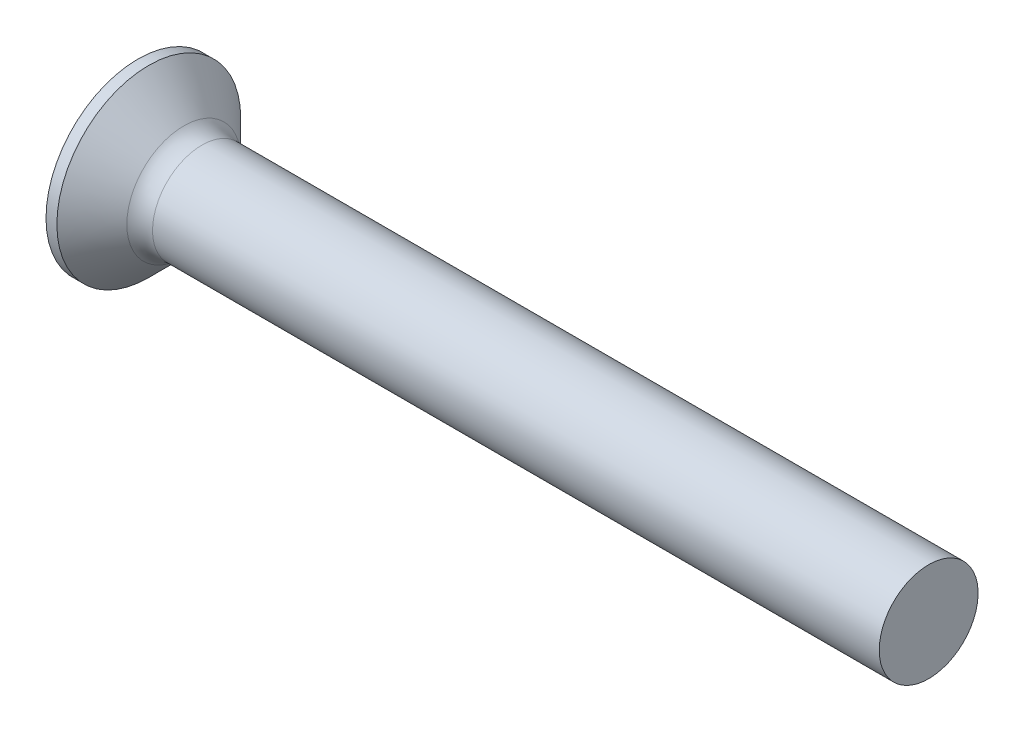
ISO-10303-21;
HEADER;
FILE_DESCRIPTION(('STEP AP214'),'2;1');
FILE_NAME('part.step','',(''),(''),'','','');
FILE_SCHEMA(('AUTOMOTIVE_DESIGN { 1 0 10303 214 1 1 1 1 }'));
ENDSEC;
DATA;
#1=APPLICATION_CONTEXT('core data for automotive mechanical design processes');
#2=APPLICATION_PROTOCOL_DEFINITION('international standard','automotive_design',2000,#1);
#3=PRODUCT_CONTEXT('',#1,'mechanical');
#4=PRODUCT('Part','Part','',(#3));
#5=PRODUCT_RELATED_PRODUCT_CATEGORY('part','',(#4));
#6=PRODUCT_DEFINITION_FORMATION('','',#4);
#7=PRODUCT_DEFINITION_CONTEXT('part definition',#1,'design');
#8=PRODUCT_DEFINITION('design','',#6,#7);
#9=PRODUCT_DEFINITION_SHAPE('','',#8);
#10=(LENGTH_UNIT() NAMED_UNIT(*) SI_UNIT(.MILLI.,.METRE.));
#11=(NAMED_UNIT(*) PLANE_ANGLE_UNIT() SI_UNIT($,.RADIAN.));
#12=(NAMED_UNIT(*) SI_UNIT($,.STERADIAN.) SOLID_ANGLE_UNIT());
#13=UNCERTAINTY_MEASURE_WITH_UNIT(LENGTH_MEASURE(1.E-05),#10,'distance_accuracy_value','');
#14=(GEOMETRIC_REPRESENTATION_CONTEXT(3) GLOBAL_UNCERTAINTY_ASSIGNED_CONTEXT((#13)) GLOBAL_UNIT_ASSIGNED_CONTEXT((#10,
#11,#12)) REPRESENTATION_CONTEXT('',''));
#15=CARTESIAN_POINT('',(0.,0.,0.));
#16=DIRECTION('',(0.,0.,1.));
#17=DIRECTION('',(1.,0.,0.));
#18=AXIS2_PLACEMENT_3D('',#15,#16,#17);
#19=CARTESIAN_POINT('',(0.,0.,0.));
#20=DIRECTION('',(-1.,0.,0.));
#21=DIRECTION('',(0.,0.,1.));
#22=AXIS2_PLACEMENT_3D('',#19,#20,#21);
#23=PLANE('',#22);
#24=CARTESIAN_POINT('',(0.,0.,0.));
#25=DIRECTION('',(-1.,0.,0.));
#26=DIRECTION('',(0.,0.,1.));
#27=AXIS2_PLACEMENT_3D('',#24,#25,#26);
#28=CIRCLE('',#27,4.65);
#29=CARTESIAN_POINT('',(0.,0.,4.65));
#30=VERTEX_POINT('',#29);
#31=EDGE_CURVE('E372',#30,#30,#28,.T.);
#32=ORIENTED_EDGE('',*,*,#31,.T.);
#33=EDGE_LOOP('',(#32));
#34=FACE_BOUND('',#33,.T.);
#35=DIRECTION('',(0.,0.,-1.));
#36=VECTOR('',#35,1.);
#37=CARTESIAN_POINT('',(0.,-0.515000000000008,2.45));
#38=LINE('',#37,#36);
#39=CARTESIAN_POINT('',(0.,-0.515000000000008,2.45));
#40=VERTEX_POINT('',#39);
#41=CARTESIAN_POINT('',(0.,-0.515000000000003,0.931375357653024));
#42=VERTEX_POINT('',#41);
#43=EDGE_CURVE('E310',#40,#42,#38,.T.);
#44=ORIENTED_EDGE('',*,*,#43,.T.);
#45=CARTESIAN_POINT('',(0.,0.,0.));
#46=DIRECTION('',(-1.,0.,0.));
#47=DIRECTION('',(0.,0.,1.));
#48=AXIS2_PLACEMENT_3D('',#45,#46,#47);
#49=CIRCLE('',#48,1.06427677642768);
#50=CARTESIAN_POINT('',(0.,-0.931375357653026,0.515));
#51=VERTEX_POINT('',#50);
#52=EDGE_CURVE('E401',#51,#42,#49,.T.);
#53=ORIENTED_EDGE('',*,*,#52,.F.);
#54=DIRECTION('',(0.,-1.,0.));
#55=VECTOR('',#54,1.);
#56=CARTESIAN_POINT('',(0.,2.45,0.515));
#57=LINE('',#56,#55);
#58=CARTESIAN_POINT('',(0.,-2.45,0.515));
#59=VERTEX_POINT('',#58);
#60=EDGE_CURVE('E336',#51,#59,#57,.T.);
#61=ORIENTED_EDGE('',*,*,#60,.T.);
#62=DIRECTION('',(0.,0.,-1.));
#63=VECTOR('',#62,1.);
#64=CARTESIAN_POINT('',(0.,-2.45,0.515));
#65=LINE('',#64,#63);
#66=CARTESIAN_POINT('',(0.,-2.45,-0.515));
#67=VERTEX_POINT('',#66);
#68=EDGE_CURVE('E341',#59,#67,#65,.T.);
#69=ORIENTED_EDGE('',*,*,#68,.T.);
#70=DIRECTION('',(0.,1.,0.));
#71=VECTOR('',#70,1.);
#72=CARTESIAN_POINT('',(0.,-2.45,-0.515));
#73=LINE('',#72,#71);
#74=CARTESIAN_POINT('',(0.,-0.931375357653026,-0.515));
#75=VERTEX_POINT('',#74);
#76=EDGE_CURVE('E337',#67,#75,#73,.T.);
#77=ORIENTED_EDGE('',*,*,#76,.T.);
#78=CARTESIAN_POINT('',(0.,-0.514999999999997,-0.931375357653028));
#79=VERTEX_POINT('',#78);
#80=EDGE_CURVE('E408',#79,#75,#49,.T.);
#81=ORIENTED_EDGE('',*,*,#80,.F.);
#82=CARTESIAN_POINT('',(0.,-0.514999999999992,-2.45));
#83=VERTEX_POINT('',#82);
#84=EDGE_CURVE('E308',#79,#83,#38,.T.);
#85=ORIENTED_EDGE('',*,*,#84,.T.);
#86=DIRECTION('',(0.,1.,0.));
#87=VECTOR('',#86,1.);
#88=CARTESIAN_POINT('',(0.,-0.514999999999992,-2.45));
#89=LINE('',#88,#87);
#90=CARTESIAN_POINT('',(0.,0.515000000000009,-2.45));
#91=VERTEX_POINT('',#90);
#92=EDGE_CURVE('E289',#83,#91,#89,.T.);
#93=ORIENTED_EDGE('',*,*,#92,.T.);
#94=DIRECTION('',(0.,0.,1.));
#95=VECTOR('',#94,1.);
#96=CARTESIAN_POINT('',(0.,0.515000000000009,-2.45));
#97=LINE('',#96,#95);
#98=CARTESIAN_POINT('',(0.,0.515000000000003,-0.931375357653024));
#99=VERTEX_POINT('',#98);
#100=EDGE_CURVE('E300',#91,#99,#97,.T.);
#101=ORIENTED_EDGE('',*,*,#100,.T.);
#102=CARTESIAN_POINT('',(0.,0.931375357653026,-0.515));
#103=VERTEX_POINT('',#102);
#104=EDGE_CURVE('E404',#103,#99,#49,.T.);
#105=ORIENTED_EDGE('',*,*,#104,.F.);
#106=CARTESIAN_POINT('',(0.,2.45,-0.515));
#107=VERTEX_POINT('',#106);
#108=EDGE_CURVE('E347',#103,#107,#73,.T.);
#109=ORIENTED_EDGE('',*,*,#108,.T.);
#110=DIRECTION('',(0.,0.,1.));
#111=VECTOR('',#110,1.);
#112=CARTESIAN_POINT('',(0.,2.45,-0.515));
#113=LINE('',#112,#111);
#114=CARTESIAN_POINT('',(0.,2.45,0.515));
#115=VERTEX_POINT('',#114);
#116=EDGE_CURVE('E333',#107,#115,#113,.T.);
#117=ORIENTED_EDGE('',*,*,#116,.T.);
#118=CARTESIAN_POINT('',(0.,0.931375357653026,0.515));
#119=VERTEX_POINT('',#118);
#120=EDGE_CURVE('E338',#115,#119,#57,.T.);
#121=ORIENTED_EDGE('',*,*,#120,.T.);
#122=CARTESIAN_POINT('',(0.,0.514999999999997,0.931375357653028));
#123=VERTEX_POINT('',#122);
#124=EDGE_CURVE('E403',#123,#119,#49,.T.);
#125=ORIENTED_EDGE('',*,*,#124,.F.);
#126=CARTESIAN_POINT('',(0.,0.514999999999991,2.45));
#127=VERTEX_POINT('',#126);
#128=EDGE_CURVE('E303',#123,#127,#97,.T.);
#129=ORIENTED_EDGE('',*,*,#128,.T.);
#130=DIRECTION('',(0.,-1.,0.));
#131=VECTOR('',#130,1.);
#132=CARTESIAN_POINT('',(0.,0.514999999999991,2.45));
#133=LINE('',#132,#131);
#134=EDGE_CURVE('E302',#127,#40,#133,.T.);
#135=ORIENTED_EDGE('',*,*,#134,.T.);
#136=EDGE_LOOP('',(#44,#53,#61,#69,#77,#81,#85,#93,#101,#105,#109,#117,#121,#125,#129,#135));
#137=FACE_BOUND('',#136,.T.);
#138=ADVANCED_FACE('F35',(#34,#137),#23,.T.);
#139=CARTESIAN_POINT('',(3.05,-0.929326147908033,0.515));
#140=DIRECTION('',(0.,0.,-1.));
#141=DIRECTION('',(0.,1.,0.));
#142=AXIS2_PLACEMENT_3D('',#139,#140,#141);
#143=PLANE('',#142);
#144=ORIENTED_EDGE('',*,*,#60,.F.);
#145=CARTESIAN_POINT('',(-1.54221347305349,-1.05291860734043,0.515));
#146=CARTESIAN_POINT('',(-1.22007147016316,-1.02783607001973,0.515));
#147=CARTESIAN_POINT('',(-0.89794181675164,-1.002592893973,0.515));
#148=CARTESIAN_POINT('',(-0.253713842852044,-0.951673528807875,0.515));
#149=CARTESIAN_POINT('',(0.0683844773279268,-0.925997335794192,0.515));
#150=CARTESIAN_POINT('',(0.712537341146251,-0.874100649412192,0.515));
#151=CARTESIAN_POINT('',(1.03459188478602,-0.847880156061489,0.515));
#152=CARTESIAN_POINT('',(1.67864013954242,-0.794723210967585,0.515));
#153=CARTESIAN_POINT('',(2.0006338510091,-0.767786763479056,0.515));
#154=CARTESIAN_POINT('',(2.56056239677505,-0.720091607539809,0.515));
#155=CARTESIAN_POINT('',(2.7985160340986,-0.699554136185312,0.515));
#156=CARTESIAN_POINT('',(3.27436149939218,-0.657782810112313,0.515));
#157=CARTESIAN_POINT('',(3.51225332755344,-0.636548957574876,0.515));
#158=CARTESIAN_POINT('',(3.98796007755392,-0.59316517097504,0.515));
#159=CARTESIAN_POINT('',(4.22577499737104,-0.571015214531953,0.515));
#160=CARTESIAN_POINT('',(4.70127802763926,-0.525368927832394,0.515));
#161=CARTESIAN_POINT('',(4.93896613655203,-0.50187258160175,0.515));
#162=CARTESIAN_POINT('',(5.17656597464715,-0.477487906778812,0.515));
#163=B_SPLINE_CURVE_WITH_KNOTS('',3,(#145,#146,#147,#148,#149,#150,#151,#152,#153,#154,#155,
#156,#157,#158,#159,#160,#161,#162),.UNSPECIFIED.,.F.,.F.,(4,2,2,2,2,2,2,2,4),(0.,
0.969351235948301,1.93871119655371,2.90807112578744,3.87742529573196,4.59393929763426,
5.3104510556289,6.0269803285681,6.74351810449256),.UNSPECIFIED.);
#164=CARTESIAN_POINT('',(3.05,-0.677477674908922,0.515));
#165=VERTEX_POINT('',#164);
#166=EDGE_CURVE('E415',#51,#165,#163,.T.);
#167=ORIENTED_EDGE('',*,*,#166,.T.);
#168=DIRECTION('',(0.,-1.,0.));
#169=VECTOR('',#168,1.);
#170=CARTESIAN_POINT('',(3.05,0.929326147908032,0.515));
#171=LINE('',#170,#169);
#172=CARTESIAN_POINT('',(3.05,-0.929326147908032,0.515));
#173=VERTEX_POINT('',#172);
#174=EDGE_CURVE('E361',#165,#173,#171,.T.);
#175=ORIENTED_EDGE('',*,*,#174,.T.);
#176=DIRECTION('',(0.89493436774996,0.446197800778958,0.));
#177=VECTOR('',#176,1.);
#178=CARTESIAN_POINT('',(0.,-2.45,0.515));
#179=LINE('',#178,#177);
#180=EDGE_CURVE('E348',#59,#173,#179,.T.);
#181=ORIENTED_EDGE('',*,*,#180,.F.);
#182=EDGE_LOOP('',(#144,#167,#175,#181));
#183=FACE_BOUND('',#182,.T.);
#184=ADVANCED_FACE('F167',(#183),#143,.T.);
#185=CARTESIAN_POINT('',(3.05,0.929326147908032,0.515));
#186=VERTEX_POINT('',#185);
#187=CARTESIAN_POINT('',(3.05,0.677477674908922,0.515));
#188=VERTEX_POINT('',#187);
#189=EDGE_CURVE('E362',#186,#188,#171,.T.);
#190=ORIENTED_EDGE('',*,*,#189,.T.);
#191=CARTESIAN_POINT('',(-1.54221347305349,1.05291860734043,0.515));
#192=CARTESIAN_POINT('',(-1.22007147016316,1.02783607001973,0.515));
#193=CARTESIAN_POINT('',(-0.89794181675164,1.002592893973,0.515));
#194=CARTESIAN_POINT('',(-0.253713842852044,0.951673528807875,0.515));
#195=CARTESIAN_POINT('',(0.0683844773279269,0.925997335794192,0.515));
#196=CARTESIAN_POINT('',(0.712537341146252,0.874100649412192,0.515));
#197=CARTESIAN_POINT('',(1.03459188478602,0.847880156061489,0.515));
#198=CARTESIAN_POINT('',(1.67864013954242,0.794723210967585,0.515));
#199=CARTESIAN_POINT('',(2.0006338510091,0.767786763479056,0.515));
#200=CARTESIAN_POINT('',(2.56056239677505,0.720091607539809,0.515));
#201=CARTESIAN_POINT('',(2.7985160340986,0.699554136185312,0.515));
#202=CARTESIAN_POINT('',(3.27436149939217,0.657782810112313,0.515));
#203=CARTESIAN_POINT('',(3.51225332755344,0.636548957574876,0.515));
#204=CARTESIAN_POINT('',(3.98796007755392,0.59316517097504,0.515));
#205=CARTESIAN_POINT('',(4.22577499737104,0.571015214531953,0.515));
#206=CARTESIAN_POINT('',(4.70127802763926,0.525368927832394,0.515));
#207=CARTESIAN_POINT('',(4.93896613655203,0.50187258160175,0.515));
#208=CARTESIAN_POINT('',(5.17656597464715,0.477487906778812,0.515));
#209=B_SPLINE_CURVE_WITH_KNOTS('',3,(#191,#192,#193,#194,#195,#196,#197,#198,#199,#200,#201,
#202,#203,#204,#205,#206,#207,#208),.UNSPECIFIED.,.F.,.F.,(4,2,2,2,2,2,2,2,4),(0.,
0.969351235948301,1.93871119655371,2.90807112578744,3.87742529573196,4.59393929763426,
5.3104510556289,6.0269803285681,6.74351810449256),.UNSPECIFIED.);
#210=EDGE_CURVE('E227',#188,#119,#209,.F.);
#211=ORIENTED_EDGE('',*,*,#210,.T.);
#212=ORIENTED_EDGE('',*,*,#120,.F.);
#213=DIRECTION('',(0.89493436774996,-0.446197800778958,0.));
#214=VECTOR('',#213,1.);
#215=CARTESIAN_POINT('',(0.,2.45,0.515));
#216=LINE('',#215,#214);
#217=EDGE_CURVE('E63',#115,#186,#216,.T.);
#218=ORIENTED_EDGE('',*,*,#217,.T.);
#219=EDGE_LOOP('',(#190,#211,#212,#218));
#220=FACE_BOUND('',#219,.T.);
#221=ADVANCED_FACE('F172',(#220),#143,.T.);
#222=CARTESIAN_POINT('',(3.05,0.929326147908032,-0.515));
#223=DIRECTION('',(0.,0.,1.));
#224=DIRECTION('',(1.,0.,0.));
#225=AXIS2_PLACEMENT_3D('',#222,#223,#224);
#226=PLANE('',#225);
#227=DIRECTION('',(0.,1.,0.));
#228=VECTOR('',#227,1.);
#229=CARTESIAN_POINT('',(3.05,-0.929326147908033,-0.515));
#230=LINE('',#229,#228);
#231=CARTESIAN_POINT('',(3.05,-0.929326147908033,-0.515));
#232=VERTEX_POINT('',#231);
#233=CARTESIAN_POINT('',(3.05,-0.677477674908922,-0.515));
#234=VERTEX_POINT('',#233);
#235=EDGE_CURVE('E312',#232,#234,#230,.T.);
#236=ORIENTED_EDGE('',*,*,#235,.T.);
#237=CARTESIAN_POINT('',(-1.54221347058903,-1.05291860714859,-0.515));
#238=CARTESIAN_POINT('',(-1.22007146800241,-1.02783606985067,-0.515));
#239=CARTESIAN_POINT('',(-0.897941814894599,-1.00259289382691,-0.515));
#240=CARTESIAN_POINT('',(-0.253713841602368,-0.951673528708394,-0.515));
#241=CARTESIAN_POINT('',(0.0683844782739385,-0.925997335718345,-0.515));
#242=CARTESIAN_POINT('',(0.712537341258934,-0.874100649402746,-0.515));
#243=CARTESIAN_POINT('',(1.03459188436907,-0.847880156095195,-0.515));
#244=CARTESIAN_POINT('',(1.67864013806642,-0.794723211090119,-0.515));
#245=CARTESIAN_POINT('',(2.00063384900369,-0.767786763647266,-0.515));
#246=CARTESIAN_POINT('',(2.56056239424054,-0.720091607757629,-0.515));
#247=CARTESIAN_POINT('',(2.79851603156427,-0.699554136405275,-0.515));
#248=CARTESIAN_POINT('',(3.27436149685826,-0.657782810337244,-0.515));
#249=CARTESIAN_POINT('',(3.51225332501977,-0.636548957802634,-0.515));
#250=CARTESIAN_POINT('',(3.98796007502083,-0.593165171209449,-0.515));
#251=CARTESIAN_POINT('',(4.22577499483828,-0.571015214770186,-0.515));
#252=CARTESIAN_POINT('',(4.70127802510735,-0.525368928080089,-0.515));
#253=CARTESIAN_POINT('',(4.93896613402064,-0.501872581855082,-0.515));
#254=CARTESIAN_POINT('',(5.17656597211643,-0.477487907039094,-0.515));
#255=B_SPLINE_CURVE_WITH_KNOTS('',3,(#237,#238,#239,#240,#241,#242,#243,#244,#245,#246,#247,
#248,#249,#250,#251,#252,#253,#254),.UNSPECIFIED.,.F.,.F.,(4,2,2,2,2,2,2,2,4),(0.,
0.9693512350346,1.93871119472626,2.90807112236582,3.87742529071622,4.59393929261848,
5.3104510506131,6.02698032355223,6.74351809947659),.UNSPECIFIED.);
#256=EDGE_CURVE('E221',#234,#75,#255,.F.);
#257=ORIENTED_EDGE('',*,*,#256,.T.);
#258=ORIENTED_EDGE('',*,*,#76,.F.);
#259=DIRECTION('',(0.89493436774996,0.446197800778958,0.));
#260=VECTOR('',#259,1.);
#261=CARTESIAN_POINT('',(0.,-2.45,-0.515));
#262=LINE('',#261,#260);
#263=EDGE_CURVE('E351',#67,#232,#262,.T.);
#264=ORIENTED_EDGE('',*,*,#263,.T.);
#265=EDGE_LOOP('',(#236,#257,#258,#264));
#266=FACE_BOUND('',#265,.T.);
#267=ADVANCED_FACE('F207',(#266),#226,.T.);
#268=ORIENTED_EDGE('',*,*,#108,.F.);
#269=CARTESIAN_POINT('',(-1.54221347058903,1.05291860714859,-0.515));
#270=CARTESIAN_POINT('',(-1.22007146800241,1.02783606985067,-0.515));
#271=CARTESIAN_POINT('',(-0.897941814894599,1.00259289382691,-0.515));
#272=CARTESIAN_POINT('',(-0.253713841602368,0.951673528708394,-0.515));
#273=CARTESIAN_POINT('',(0.0683844782739385,0.925997335718345,-0.515));
#274=CARTESIAN_POINT('',(0.712537341258934,0.874100649402746,-0.515));
#275=CARTESIAN_POINT('',(1.03459188436907,0.847880156095195,-0.515));
#276=CARTESIAN_POINT('',(1.67864013806642,0.794723211090119,-0.515));
#277=CARTESIAN_POINT('',(2.00063384900369,0.767786763647266,-0.515));
#278=CARTESIAN_POINT('',(2.56056239424054,0.720091607757629,-0.515));
#279=CARTESIAN_POINT('',(2.79851603156427,0.699554136405275,-0.515));
#280=CARTESIAN_POINT('',(3.27436149685826,0.657782810337244,-0.515));
#281=CARTESIAN_POINT('',(3.51225332501977,0.636548957802634,-0.515));
#282=CARTESIAN_POINT('',(3.98796007502083,0.593165171209449,-0.515));
#283=CARTESIAN_POINT('',(4.22577499483827,0.571015214770186,-0.515));
#284=CARTESIAN_POINT('',(4.70127802510734,0.525368928080089,-0.515));
#285=CARTESIAN_POINT('',(4.93896613402064,0.501872581855082,-0.515));
#286=CARTESIAN_POINT('',(5.17656597211643,0.477487907039095,-0.515));
#287=B_SPLINE_CURVE_WITH_KNOTS('',3,(#269,#270,#271,#272,#273,#274,#275,#276,#277,#278,#279,
#280,#281,#282,#283,#284,#285,#286),.UNSPECIFIED.,.F.,.F.,(4,2,2,2,2,2,2,2,4),(0.,
0.9693512350346,1.93871119472626,2.90807112236582,3.87742529071622,4.59393929261848,
5.3104510506131,6.02698032355223,6.74351809947659),.UNSPECIFIED.);
#288=CARTESIAN_POINT('',(3.05,0.677477674908922,-0.515));
#289=VERTEX_POINT('',#288);
#290=EDGE_CURVE('E215',#103,#289,#287,.T.);
#291=ORIENTED_EDGE('',*,*,#290,.T.);
#292=CARTESIAN_POINT('',(3.05,0.929326147908032,-0.515));
#293=VERTEX_POINT('',#292);
#294=EDGE_CURVE('E309',#289,#293,#230,.T.);
#295=ORIENTED_EDGE('',*,*,#294,.T.);
#296=DIRECTION('',(0.89493436774996,-0.446197800778958,0.));
#297=VECTOR('',#296,1.);
#298=CARTESIAN_POINT('',(0.,2.45,-0.515));
#299=LINE('',#298,#297);
#300=EDGE_CURVE('E355',#107,#293,#299,.T.);
#301=ORIENTED_EDGE('',*,*,#300,.F.);
#302=EDGE_LOOP('',(#268,#291,#295,#301));
#303=FACE_BOUND('',#302,.T.);
#304=ADVANCED_FACE('F199',(#303),#226,.T.);
#305=CARTESIAN_POINT('',(3.05,-0.929326147908033,-0.515));
#306=DIRECTION('',(-1.,0.,0.));
#307=DIRECTION('',(0.,0.,1.));
#308=AXIS2_PLACEMENT_3D('',#305,#306,#307);
#309=PLANE('',#308);
#310=ORIENTED_EDGE('',*,*,#174,.F.);
#311=CARTESIAN_POINT('',(3.05,0.,0.));
#312=DIRECTION('',(-1.,0.,0.));
#313=DIRECTION('',(0.,0.,1.));
#314=AXIS2_PLACEMENT_3D('',#311,#312,#313);
#315=CIRCLE('',#314,0.850999999999999);
#316=EDGE_CURVE('E392',#234,#165,#315,.T.);
#317=ORIENTED_EDGE('',*,*,#316,.F.);
#318=ORIENTED_EDGE('',*,*,#235,.F.);
#319=DIRECTION('',(0.,0.,-1.));
#320=VECTOR('',#319,1.);
#321=CARTESIAN_POINT('',(3.05,-0.929326147908032,0.515));
#322=LINE('',#321,#320);
#323=EDGE_CURVE('E358',#173,#232,#322,.T.);
#324=ORIENTED_EDGE('',*,*,#323,.F.);
#325=EDGE_LOOP('',(#310,#317,#318,#324));
#326=FACE_BOUND('',#325,.T.);
#327=ADVANCED_FACE('F195',(#326),#309,.T.);
#328=DIRECTION('',(0.,0.,-1.));
#329=VECTOR('',#328,1.);
#330=CARTESIAN_POINT('',(3.05,-0.515000000000003,0.92932614790803));
#331=LINE('',#330,#329);
#332=CARTESIAN_POINT('',(3.05,-0.514999999999998,-0.677477674908923));
#333=VERTEX_POINT('',#332);
#334=CARTESIAN_POINT('',(3.05,-0.514999999999997,-0.929326147908034));
#335=VERTEX_POINT('',#334);
#336=EDGE_CURVE('E325',#333,#335,#331,.T.);
#337=ORIENTED_EDGE('',*,*,#336,.F.);
#338=CARTESIAN_POINT('',(3.05,0.515000000000002,-0.67747767490892));
#339=VERTEX_POINT('',#338);
#340=EDGE_CURVE('E399',#339,#333,#315,.T.);
#341=ORIENTED_EDGE('',*,*,#340,.F.);
#342=DIRECTION('',(0.,0.,1.));
#343=VECTOR('',#342,1.);
#344=CARTESIAN_POINT('',(3.05,0.515000000000003,-0.929326147908031));
#345=LINE('',#344,#343);
#346=CARTESIAN_POINT('',(3.05,0.515000000000003,-0.929326147908031));
#347=VERTEX_POINT('',#346);
#348=EDGE_CURVE('E326',#347,#339,#345,.T.);
#349=ORIENTED_EDGE('',*,*,#348,.F.);
#350=DIRECTION('',(0.,1.,0.));
#351=VECTOR('',#350,1.);
#352=CARTESIAN_POINT('',(3.05,-0.514999999999997,-0.929326147908034));
#353=LINE('',#352,#351);
#354=EDGE_CURVE('E292',#335,#347,#353,.T.);
#355=ORIENTED_EDGE('',*,*,#354,.F.);
#356=EDGE_LOOP('',(#337,#341,#349,#355));
#357=FACE_BOUND('',#356,.T.);
#358=ADVANCED_FACE('F198',(#357),#309,.T.);
#359=ORIENTED_EDGE('',*,*,#294,.F.);
#360=EDGE_CURVE('E402',#188,#289,#315,.T.);
#361=ORIENTED_EDGE('',*,*,#360,.F.);
#362=ORIENTED_EDGE('',*,*,#189,.F.);
#363=DIRECTION('',(0.,0.,1.));
#364=VECTOR('',#363,1.);
#365=CARTESIAN_POINT('',(3.05,0.929326147908032,-0.515));
#366=LINE('',#365,#364);
#367=EDGE_CURVE('E359',#293,#186,#366,.T.);
#368=ORIENTED_EDGE('',*,*,#367,.F.);
#369=EDGE_LOOP('',(#359,#361,#362,#368));
#370=FACE_BOUND('',#369,.T.);
#371=ADVANCED_FACE('F431',(#370),#309,.T.);
#372=CARTESIAN_POINT('',(3.05,0.514999999999998,0.677477674908924));
#373=VERTEX_POINT('',#372);
#374=CARTESIAN_POINT('',(3.05,0.514999999999997,0.929326147908034));
#375=VERTEX_POINT('',#374);
#376=EDGE_CURVE('E332',#373,#375,#345,.T.);
#377=ORIENTED_EDGE('',*,*,#376,.F.);
#378=CARTESIAN_POINT('',(3.05,-0.515000000000002,0.67747767490892));
#379=VERTEX_POINT('',#378);
#380=EDGE_CURVE('E400',#379,#373,#315,.T.);
#381=ORIENTED_EDGE('',*,*,#380,.F.);
#382=CARTESIAN_POINT('',(3.05,-0.515000000000003,0.929326147908031));
#383=VERTEX_POINT('',#382);
#384=EDGE_CURVE('E327',#383,#379,#331,.T.);
#385=ORIENTED_EDGE('',*,*,#384,.F.);
#386=DIRECTION('',(0.,-1.,0.));
#387=VECTOR('',#386,1.);
#388=CARTESIAN_POINT('',(3.05,0.514999999999997,0.929326147908034));
#389=LINE('',#388,#387);
#390=EDGE_CURVE('E322',#375,#383,#389,.T.);
#391=ORIENTED_EDGE('',*,*,#390,.F.);
#392=EDGE_LOOP('',(#377,#381,#385,#391));
#393=FACE_BOUND('',#392,.T.);
#394=ADVANCED_FACE('F201',(#393),#309,.T.);
#395=CARTESIAN_POINT('',(3.05,-0.514999999999997,-0.929326147908034));
#396=DIRECTION('',(0.,1.,0.));
#397=DIRECTION('',(0.,0.,1.));
#398=AXIS2_PLACEMENT_3D('',#395,#396,#397);
#399=PLANE('',#398);
#400=ORIENTED_EDGE('',*,*,#84,.F.);
#401=CARTESIAN_POINT('',(-1.54221347058903,-0.514999999999996,-1.05291860714859));
#402=CARTESIAN_POINT('',(-1.22007146800241,-0.514999999999997,-1.02783606985067));
#403=CARTESIAN_POINT('',(-0.897941814894598,-0.514999999999997,-1.00259289382691));
#404=CARTESIAN_POINT('',(-0.253713841602368,-0.514999999999997,-0.951673528708396));
#405=CARTESIAN_POINT('',(0.0683844782739389,-0.514999999999997,-0.925997335718346));
#406=CARTESIAN_POINT('',(0.712537341258934,-0.514999999999997,-0.874100649402748));
#407=CARTESIAN_POINT('',(1.03459188436907,-0.514999999999997,-0.847880156095197));
#408=CARTESIAN_POINT('',(1.67864013806642,-0.514999999999997,-0.794723211090121));
#409=CARTESIAN_POINT('',(2.00063384900369,-0.514999999999997,-0.767786763647268));
#410=CARTESIAN_POINT('',(2.56056239424054,-0.514999999999998,-0.72009160775763));
#411=CARTESIAN_POINT('',(2.79851603156427,-0.514999999999998,-0.699554136405276));
#412=CARTESIAN_POINT('',(3.27436149685826,-0.514999999999998,-0.657782810337246));
#413=CARTESIAN_POINT('',(3.51225332501977,-0.514999999999998,-0.636548957802636));
#414=CARTESIAN_POINT('',(3.98796007502083,-0.514999999999998,-0.59316517120945));
#415=CARTESIAN_POINT('',(4.22577499483828,-0.514999999999998,-0.571015214770188));
#416=CARTESIAN_POINT('',(4.70127802510735,-0.514999999999999,-0.52536892808009));
#417=CARTESIAN_POINT('',(4.93896613402064,-0.514999999999999,-0.501872581855084));
#418=CARTESIAN_POINT('',(5.17656597211643,-0.514999999999999,-0.477487907039096));
#419=B_SPLINE_CURVE_WITH_KNOTS('',3,(#401,#402,#403,#404,#405,#406,#407,#408,#409,#410,#411,
#412,#413,#414,#415,#416,#417,#418),.UNSPECIFIED.,.F.,.F.,(4,2,2,2,2,2,2,2,4),(0.,
0.969351235034601,1.93871119472626,2.90807112236582,3.87742529071622,4.59393929261848,
5.3104510506131,6.02698032355223,6.74351809947659),.UNSPECIFIED.);
#420=EDGE_CURVE('E252',#79,#333,#419,.T.);
#421=ORIENTED_EDGE('',*,*,#420,.T.);
#422=ORIENTED_EDGE('',*,*,#336,.T.);
#423=DIRECTION('',(0.89493436774996,0.,0.446197800778958));
#424=VECTOR('',#423,1.);
#425=CARTESIAN_POINT('',(0.,-0.514999999999992,-2.45));
#426=LINE('',#425,#424);
#427=EDGE_CURVE('E295',#83,#335,#426,.T.);
#428=ORIENTED_EDGE('',*,*,#427,.F.);
#429=EDGE_LOOP('',(#400,#421,#422,#428));
#430=FACE_BOUND('',#429,.T.);
#431=ADVANCED_FACE('F258',(#430),#399,.T.);
#432=CARTESIAN_POINT('',(3.05,0.514999999999997,0.929326147908034));
#433=DIRECTION('',(0.,-1.,0.));
#434=DIRECTION('',(1.,0.,0.));
#435=AXIS2_PLACEMENT_3D('',#432,#433,#434);
#436=PLANE('',#435);
#437=ORIENTED_EDGE('',*,*,#348,.T.);
#438=CARTESIAN_POINT('',(-1.54221347058903,0.515000000000004,-1.05291860714859));
#439=CARTESIAN_POINT('',(-1.22007146800242,0.515000000000003,-1.02783606985067));
#440=CARTESIAN_POINT('',(-0.897941814894599,0.515000000000003,-1.00259289382691));
#441=CARTESIAN_POINT('',(-0.253713841602369,0.515000000000003,-0.951673528708392));
#442=CARTESIAN_POINT('',(0.0683844782739381,0.515000000000003,-0.925997335718343));
#443=CARTESIAN_POINT('',(0.712537341258934,0.515000000000003,-0.874100649402745));
#444=CARTESIAN_POINT('',(1.03459188436907,0.515000000000003,-0.847880156095193));
#445=CARTESIAN_POINT('',(1.67864013806642,0.515000000000003,-0.794723211090117));
#446=CARTESIAN_POINT('',(2.00063384900369,0.515000000000003,-0.767786763647264));
#447=CARTESIAN_POINT('',(2.56056239424054,0.515000000000003,-0.720091607757627));
#448=CARTESIAN_POINT('',(2.79851603156427,0.515000000000003,-0.699554136405273));
#449=CARTESIAN_POINT('',(3.27436149685826,0.515000000000002,-0.657782810337243));
#450=CARTESIAN_POINT('',(3.51225332501977,0.515000000000002,-0.636548957802632));
#451=CARTESIAN_POINT('',(3.98796007502083,0.515000000000002,-0.593165171209447));
#452=CARTESIAN_POINT('',(4.22577499483828,0.515000000000002,-0.571015214770184));
#453=CARTESIAN_POINT('',(4.70127802510735,0.515000000000002,-0.525368928080087));
#454=CARTESIAN_POINT('',(4.93896613402064,0.515000000000002,-0.50187258185508));
#455=CARTESIAN_POINT('',(5.17656597211643,0.515000000000002,-0.477487907039093));
#456=B_SPLINE_CURVE_WITH_KNOTS('',3,(#438,#439,#440,#441,#442,#443,#444,#445,#446,#447,#448,
#449,#450,#451,#452,#453,#454,#455),.UNSPECIFIED.,.F.,.F.,(4,2,2,2,2,2,2,2,4),(0.,
0.969351235034599,1.93871119472626,2.90807112236582,3.87742529071622,4.59393929261848,
5.3104510506131,6.02698032355223,6.74351809947659),.UNSPECIFIED.);
#457=EDGE_CURVE('E247',#339,#99,#456,.F.);
#458=ORIENTED_EDGE('',*,*,#457,.T.);
#459=ORIENTED_EDGE('',*,*,#100,.F.);
#460=DIRECTION('',(0.89493436774996,0.,0.446197800778958));
#461=VECTOR('',#460,1.);
#462=CARTESIAN_POINT('',(0.,0.515000000000009,-2.45));
#463=LINE('',#462,#461);
#464=EDGE_CURVE('E285',#91,#347,#463,.T.);
#465=ORIENTED_EDGE('',*,*,#464,.T.);
#466=EDGE_LOOP('',(#437,#458,#459,#465));
#467=FACE_BOUND('',#466,.T.);
#468=ADVANCED_FACE('F261',(#467),#436,.T.);
#469=ORIENTED_EDGE('',*,*,#384,.T.);
#470=CARTESIAN_POINT('',(-1.54221347305349,-0.515000000000003,1.05291860734043));
#471=CARTESIAN_POINT('',(-1.22007147016316,-0.515000000000003,1.02783607001973));
#472=CARTESIAN_POINT('',(-0.89794181675164,-0.515000000000003,1.002592893973));
#473=CARTESIAN_POINT('',(-0.253713842852044,-0.515000000000003,0.951673528807873));
#474=CARTESIAN_POINT('',(0.0683844773279267,-0.515000000000003,0.92599733579419));
#475=CARTESIAN_POINT('',(0.712537341146251,-0.515000000000003,0.87410064941219));
#476=CARTESIAN_POINT('',(1.03459188478602,-0.515000000000003,0.847880156061488));
#477=CARTESIAN_POINT('',(1.67864013954242,-0.515000000000003,0.794723210967584));
#478=CARTESIAN_POINT('',(2.0006338510091,-0.515000000000003,0.767786763479054));
#479=CARTESIAN_POINT('',(2.56056239677505,-0.515000000000003,0.720091607539807));
#480=CARTESIAN_POINT('',(2.7985160340986,-0.515000000000003,0.69955413618531));
#481=CARTESIAN_POINT('',(3.27436149939218,-0.515000000000002,0.657782810112311));
#482=CARTESIAN_POINT('',(3.51225332755344,-0.515000000000002,0.636548957574874));
#483=CARTESIAN_POINT('',(3.98796007755392,-0.515000000000002,0.593165170975038));
#484=CARTESIAN_POINT('',(4.22577499737104,-0.515000000000002,0.571015214531951));
#485=CARTESIAN_POINT('',(4.70127802763926,-0.515000000000002,0.525368927832392));
#486=CARTESIAN_POINT('',(4.93896613655203,-0.515000000000002,0.501872581601749));
#487=CARTESIAN_POINT('',(5.17656597464715,-0.515000000000002,0.47748790677881));
#488=B_SPLINE_CURVE_WITH_KNOTS('',3,(#470,#471,#472,#473,#474,#475,#476,#477,#478,#479,#480,
#481,#482,#483,#484,#485,#486,#487),.UNSPECIFIED.,.F.,.F.,(4,2,2,2,2,2,2,2,4),(0.,
0.969351235948301,1.93871119655371,2.90807112578744,3.87742529573196,4.59393929763426,
5.3104510556289,6.0269803285681,6.74351810449256),.UNSPECIFIED.);
#489=EDGE_CURVE('E240',#379,#42,#488,.F.);
#490=ORIENTED_EDGE('',*,*,#489,.T.);
#491=ORIENTED_EDGE('',*,*,#43,.F.);
#492=DIRECTION('',(0.89493436774996,0.,-0.446197800778958));
#493=VECTOR('',#492,1.);
#494=CARTESIAN_POINT('',(0.,-0.515000000000008,2.45));
#495=LINE('',#494,#493);
#496=EDGE_CURVE('E296',#40,#383,#495,.T.);
#497=ORIENTED_EDGE('',*,*,#496,.T.);
#498=EDGE_LOOP('',(#469,#490,#491,#497));
#499=FACE_BOUND('',#498,.T.);
#500=ADVANCED_FACE('F263',(#499),#399,.T.);
#501=ORIENTED_EDGE('',*,*,#128,.F.);
#502=CARTESIAN_POINT('',(-1.54221347058903,0.514999999999996,1.05291860714859));
#503=CARTESIAN_POINT('',(-1.22007146800241,0.514999999999996,1.02783606985067));
#504=CARTESIAN_POINT('',(-0.897941814894599,0.514999999999996,1.00259289382691));
#505=CARTESIAN_POINT('',(-0.253713841602368,0.514999999999997,0.951673528708396));
#506=CARTESIAN_POINT('',(0.0683844782739385,0.514999999999997,0.925997335718346));
#507=CARTESIAN_POINT('',(0.712537341258934,0.514999999999997,0.874100649402748));
#508=CARTESIAN_POINT('',(1.03459188436907,0.514999999999997,0.847880156095197));
#509=CARTESIAN_POINT('',(1.67864013806642,0.514999999999997,0.794723211090121));
#510=CARTESIAN_POINT('',(2.00063384900369,0.514999999999997,0.767786763647268));
#511=CARTESIAN_POINT('',(2.56056239424054,0.514999999999998,0.720091607757631));
#512=CARTESIAN_POINT('',(2.79851603156427,0.514999999999998,0.699554136405277));
#513=CARTESIAN_POINT('',(3.27436149685826,0.514999999999998,0.657782810337246));
#514=CARTESIAN_POINT('',(3.51225332501977,0.514999999999998,0.636548957802636));
#515=CARTESIAN_POINT('',(3.98796007502083,0.514999999999998,0.593165171209451));
#516=CARTESIAN_POINT('',(4.22577499483827,0.514999999999998,0.571015214770188));
#517=CARTESIAN_POINT('',(4.70127802510734,0.514999999999998,0.525368928080091));
#518=CARTESIAN_POINT('',(4.93896613402064,0.514999999999998,0.501872581855084));
#519=CARTESIAN_POINT('',(5.17656597211643,0.514999999999998,0.477487907039096));
#520=B_SPLINE_CURVE_WITH_KNOTS('',3,(#502,#503,#504,#505,#506,#507,#508,#509,#510,#511,#512,
#513,#514,#515,#516,#517,#518,#519),.UNSPECIFIED.,.F.,.F.,(4,2,2,2,2,2,2,2,4),(0.,
0.9693512350346,1.93871119472626,2.90807112236582,3.87742529071622,4.59393929261848,
5.3104510506131,6.02698032355223,6.74351809947659),.UNSPECIFIED.);
#521=EDGE_CURVE('E11',#123,#373,#520,.T.);
#522=ORIENTED_EDGE('',*,*,#521,.T.);
#523=ORIENTED_EDGE('',*,*,#376,.T.);
#524=DIRECTION('',(0.89493436774996,0.,-0.446197800778958));
#525=VECTOR('',#524,1.);
#526=CARTESIAN_POINT('',(0.,0.514999999999991,2.45));
#527=LINE('',#526,#525);
#528=EDGE_CURVE('E319',#127,#375,#527,.T.);
#529=ORIENTED_EDGE('',*,*,#528,.F.);
#530=EDGE_LOOP('',(#501,#522,#523,#529));
#531=FACE_BOUND('',#530,.T.);
#532=ADVANCED_FACE('F182',(#531),#436,.T.);
#533=CARTESIAN_POINT('',(-6.34999999999999,0.,0.));
#534=DIRECTION('',(-1.,0.,0.));
#535=DIRECTION('',(0.,0.,1.));
#536=AXIS2_PLACEMENT_3D('',#533,#534,#535);
#537=CYLINDRICAL_SURFACE('',#536,4.65);
#538=CARTESIAN_POINT('',(0.550000000000008,0.,0.));
#539=DIRECTION('',(-1.,0.,0.));
#540=DIRECTION('',(0.,0.,1.));
#541=AXIS2_PLACEMENT_3D('',#538,#539,#540);
#542=CIRCLE('',#541,4.65);
#543=CARTESIAN_POINT('',(0.550000000000008,0.,4.65));
#544=VERTEX_POINT('',#543);
#545=EDGE_CURVE('E369',#544,#544,#542,.T.);
#546=ORIENTED_EDGE('',*,*,#545,.T.);
#547=EDGE_LOOP('',(#546));
#548=FACE_BOUND('',#547,.T.);
#549=ORIENTED_EDGE('',*,*,#31,.F.);
#550=EDGE_LOOP('',(#549));
#551=FACE_BOUND('',#550,.T.);
#552=ADVANCED_FACE('F178',(#548,#551),#537,.T.);
#553=CARTESIAN_POINT('',(0.550000000000008,0.,0.));
#554=DIRECTION('',(-1.,0.,0.));
#555=DIRECTION('',(0.,0.,1.));
#556=AXIS2_PLACEMENT_3D('',#553,#554,#555);
#557=CONICAL_SURFACE('',#556,4.65,0.78539816339745);
#558=CARTESIAN_POINT('',(2.31923881554251,0.,0.));
#559=DIRECTION('',(-1.,0.,0.));
#560=DIRECTION('',(0.,0.,1.));
#561=AXIS2_PLACEMENT_3D('',#558,#559,#560);
#562=CIRCLE('',#561,2.88076118445749);
#563=CARTESIAN_POINT('',(2.31923881554251,0.,2.88076118445749));
#564=VERTEX_POINT('',#563);
#565=EDGE_CURVE('E374',#564,#564,#562,.T.);
#566=ORIENTED_EDGE('',*,*,#565,.T.);
#567=EDGE_LOOP('',(#566));
#568=FACE_BOUND('',#567,.T.);
#569=ORIENTED_EDGE('',*,*,#545,.F.);
#570=EDGE_LOOP('',(#569));
#571=FACE_BOUND('',#570,.T.);
#572=ADVANCED_FACE('F181',(#568,#571),#557,.T.);
#573=CARTESIAN_POINT('',(-6.34999999999999,0.,0.));
#574=DIRECTION('',(-1.,0.,0.));
#575=DIRECTION('',(0.,0.,1.));
#576=AXIS2_PLACEMENT_3D('',#573,#574,#575);
#577=CYLINDRICAL_SURFACE('',#576,2.5);
#578=CARTESIAN_POINT('',(3.23847763108503,0.,0.));
#579=DIRECTION('',(-1.,0.,0.));
#580=DIRECTION('',(0.,0.,1.));
#581=AXIS2_PLACEMENT_3D('',#578,#579,#580);
#582=CIRCLE('',#581,2.5);
#583=CARTESIAN_POINT('',(3.23847763108503,0.,2.5));
#584=VERTEX_POINT('',#583);
#585=EDGE_CURVE('E48',#584,#584,#582,.F.);
#586=ORIENTED_EDGE('',*,*,#585,.T.);
#587=EDGE_LOOP('',(#586));
#588=FACE_BOUND('',#587,.T.);
#589=CARTESIAN_POINT('',(40.,0.,0.));
#590=DIRECTION('',(-1.,0.,0.));
#591=DIRECTION('',(0.,0.,1.));
#592=AXIS2_PLACEMENT_3D('',#589,#590,#591);
#593=CIRCLE('',#592,2.5);
#594=CARTESIAN_POINT('',(40.,0.,2.5));
#595=VERTEX_POINT('',#594);
#596=EDGE_CURVE('E344',#595,#595,#593,.T.);
#597=ORIENTED_EDGE('',*,*,#596,.T.);
#598=EDGE_LOOP('',(#597));
#599=FACE_BOUND('',#598,.T.);
#600=ADVANCED_FACE('F186',(#588,#599),#577,.T.);
#601=CARTESIAN_POINT('',(40.,2.5,0.));
#602=DIRECTION('',(1.,0.,0.));
#603=DIRECTION('',(0.,0.,-1.));
#604=AXIS2_PLACEMENT_3D('',#601,#602,#603);
#605=PLANE('',#604);
#606=ORIENTED_EDGE('',*,*,#596,.F.);
#607=EDGE_LOOP('',(#606));
#608=FACE_BOUND('',#607,.T.);
#609=ADVANCED_FACE('F190',(#608),#605,.T.);
#610=CARTESIAN_POINT('',(3.23847763108503,0.,0.));
#611=DIRECTION('',(-1.,0.,0.));
#612=DIRECTION('',(0.,0.,1.));
#613=AXIS2_PLACEMENT_3D('',#610,#611,#612);
#614=TOROIDAL_SURFACE('',#613,3.8,1.3);
#615=ORIENTED_EDGE('',*,*,#585,.F.);
#616=EDGE_LOOP('',(#615));
#617=FACE_BOUND('',#616,.T.);
#618=ORIENTED_EDGE('',*,*,#565,.F.);
#619=EDGE_LOOP('',(#618));
#620=FACE_BOUND('',#619,.T.);
#621=ADVANCED_FACE('F37',(#617,#620),#614,.F.);
#622=CARTESIAN_POINT('',(3.05,-0.929326147908033,-0.515));
#623=DIRECTION('',(-0.446197800778958,0.894934367749961,0.));
#624=DIRECTION('',(-0.89493436774996,-0.446197800778958,0.));
#625=AXIS2_PLACEMENT_3D('',#622,#623,#624);
#626=PLANE('',#625);
#627=ORIENTED_EDGE('',*,*,#263,.F.);
#628=ORIENTED_EDGE('',*,*,#68,.F.);
#629=ORIENTED_EDGE('',*,*,#180,.T.);
#630=ORIENTED_EDGE('',*,*,#323,.T.);
#631=EDGE_LOOP('',(#627,#628,#629,#630));
#632=FACE_BOUND('',#631,.T.);
#633=ADVANCED_FACE('F206',(#632),#626,.T.);
#634=CARTESIAN_POINT('',(3.05,0.929326147908032,0.515));
#635=DIRECTION('',(-0.446197800778958,-0.894934367749961,0.));
#636=DIRECTION('',(0.89493436774996,-0.446197800778958,0.));
#637=AXIS2_PLACEMENT_3D('',#634,#635,#636);
#638=PLANE('',#637);
#639=ORIENTED_EDGE('',*,*,#217,.F.);
#640=ORIENTED_EDGE('',*,*,#116,.F.);
#641=ORIENTED_EDGE('',*,*,#300,.T.);
#642=ORIENTED_EDGE('',*,*,#367,.T.);
#643=EDGE_LOOP('',(#639,#640,#641,#642));
#644=FACE_BOUND('',#643,.T.);
#645=ADVANCED_FACE('F202',(#644),#638,.T.);
#646=CARTESIAN_POINT('',(3.05,0.515000000000003,-0.929326147908031));
#647=DIRECTION('',(-0.446197800778958,0.,0.894934367749961));
#648=DIRECTION('',(-0.89493436774996,0.,-0.446197800778958));
#649=AXIS2_PLACEMENT_3D('',#646,#647,#648);
#650=PLANE('',#649);
#651=ORIENTED_EDGE('',*,*,#464,.F.);
#652=ORIENTED_EDGE('',*,*,#92,.F.);
#653=ORIENTED_EDGE('',*,*,#427,.T.);
#654=ORIENTED_EDGE('',*,*,#354,.T.);
#655=EDGE_LOOP('',(#651,#652,#653,#654));
#656=FACE_BOUND('',#655,.T.);
#657=ADVANCED_FACE('F205',(#656),#650,.T.);
#658=CARTESIAN_POINT('',(3.05,-0.515000000000003,0.92932614790803));
#659=DIRECTION('',(-0.446197800778958,0.,-0.894934367749961));
#660=DIRECTION('',(0.89493436774996,0.,-0.446197800778958));
#661=AXIS2_PLACEMENT_3D('',#658,#659,#660);
#662=PLANE('',#661);
#663=ORIENTED_EDGE('',*,*,#496,.F.);
#664=ORIENTED_EDGE('',*,*,#134,.F.);
#665=ORIENTED_EDGE('',*,*,#528,.T.);
#666=ORIENTED_EDGE('',*,*,#390,.T.);
#667=EDGE_LOOP('',(#663,#664,#665,#666));
#668=FACE_BOUND('',#667,.T.);
#669=ADVANCED_FACE('F269',(#668),#662,.T.);
#670=CARTESIAN_POINT('',(3.05,0.,0.));
#671=DIRECTION('',(-1.,0.,0.));
#672=DIRECTION('',(0.,0.,1.));
#673=AXIS2_PLACEMENT_3D('',#670,#671,#672);
#674=CONICAL_SURFACE('',#673,0.850999999999999,0.069813170079766);
#675=ORIENTED_EDGE('',*,*,#52,.T.);
#676=ORIENTED_EDGE('',*,*,#489,.F.);
#677=EDGE_CURVE('E397',#165,#379,#315,.T.);
#678=ORIENTED_EDGE('',*,*,#677,.F.);
#679=ORIENTED_EDGE('',*,*,#166,.F.);
#680=EDGE_LOOP('',(#675,#676,#678,#679));
#681=FACE_BOUND('',#680,.T.);
#682=ADVANCED_FACE('F165',(#681),#674,.F.);
#683=EDGE_CURVE('E55',#373,#188,#315,.T.);
#684=ORIENTED_EDGE('',*,*,#683,.F.);
#685=ORIENTED_EDGE('',*,*,#521,.F.);
#686=ORIENTED_EDGE('',*,*,#124,.T.);
#687=ORIENTED_EDGE('',*,*,#210,.F.);
#688=EDGE_LOOP('',(#684,#685,#686,#687));
#689=FACE_BOUND('',#688,.T.);
#690=ADVANCED_FACE('F454',(#689),#674,.F.);
#691=EDGE_CURVE('E396',#333,#234,#315,.T.);
#692=ORIENTED_EDGE('',*,*,#691,.F.);
#693=ORIENTED_EDGE('',*,*,#420,.F.);
#694=ORIENTED_EDGE('',*,*,#80,.T.);
#695=ORIENTED_EDGE('',*,*,#256,.F.);
#696=EDGE_LOOP('',(#692,#693,#694,#695));
#697=FACE_BOUND('',#696,.T.);
#698=ADVANCED_FACE('F163',(#697),#674,.F.);
#699=ORIENTED_EDGE('',*,*,#104,.T.);
#700=ORIENTED_EDGE('',*,*,#457,.F.);
#701=EDGE_CURVE('E434',#289,#339,#315,.T.);
#702=ORIENTED_EDGE('',*,*,#701,.F.);
#703=ORIENTED_EDGE('',*,*,#290,.F.);
#704=EDGE_LOOP('',(#699,#700,#702,#703));
#705=FACE_BOUND('',#704,.T.);
#706=ADVANCED_FACE('F157',(#705),#674,.F.);
#707=CARTESIAN_POINT('',(3.3265066614942,0.,0.));
#708=DIRECTION('',(-1.,0.,0.));
#709=DIRECTION('',(0.,0.,1.));
#710=AXIS2_PLACEMENT_3D('',#707,#708,#709);
#711=CONICAL_SURFACE('',#710,0.,1.25663706143592);
#712=ORIENTED_EDGE('',*,*,#683,.T.);
#713=ORIENTED_EDGE('',*,*,#360,.T.);
#714=ORIENTED_EDGE('',*,*,#701,.T.);
#715=ORIENTED_EDGE('',*,*,#340,.T.);
#716=ORIENTED_EDGE('',*,*,#691,.T.);
#717=ORIENTED_EDGE('',*,*,#316,.T.);
#718=ORIENTED_EDGE('',*,*,#677,.T.);
#719=ORIENTED_EDGE('',*,*,#380,.T.);
#720=EDGE_LOOP('',(#712,#713,#714,#715,#716,#717,#718,#719));
#721=FACE_BOUND('',#720,.T.);
#722=CARTESIAN_POINT('',(3.3265066614942,0.,0.));
#723=VERTEX_POINT('',#722);
#724=VERTEX_LOOP('',#723);
#725=FACE_BOUND('',#724,.T.);
#726=ADVANCED_FACE('F155',(#721,#725),#711,.F.);
#727=CLOSED_SHELL('',(#138,#184,#221,#267,#304,#327,#358,#371,#394,#431,#468,#500,#532,#552,
#572,#600,#609,#621,#633,#645,#657,#669,#682,#690,#698,#706,#726));
#728=MANIFOLD_SOLID_BREP('B2',#727);
#729=ADVANCED_BREP_SHAPE_REPRESENTATION('',(#18,#728),#14);
#730=SHAPE_DEFINITION_REPRESENTATION(#9,#729);
ENDSEC;
END-ISO-10303-21;
